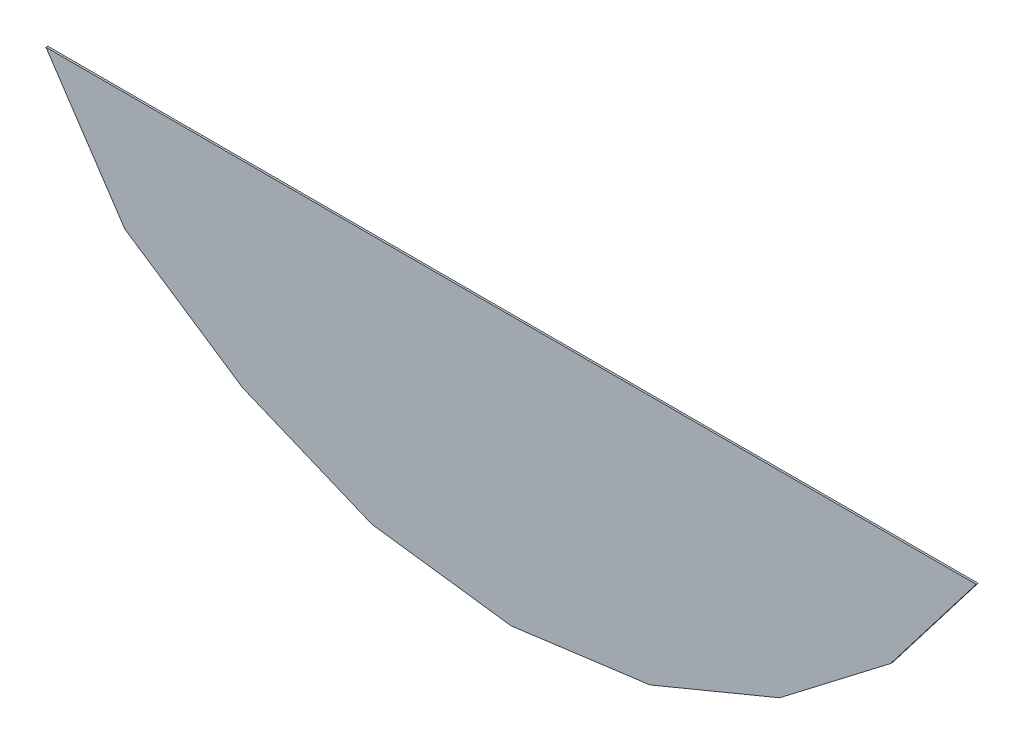
ISO-10303-21;
HEADER;
FILE_DESCRIPTION(('STEP AP214'),'2;1');
FILE_NAME('part.step','',(''),(''),'','','');
FILE_SCHEMA(('AUTOMOTIVE_DESIGN { 1 0 10303 214 1 1 1 1 }'));
ENDSEC;
DATA;
#1=APPLICATION_CONTEXT('core data for automotive mechanical design processes');
#2=APPLICATION_PROTOCOL_DEFINITION('international standard','automotive_design',2000,#1);
#3=PRODUCT_CONTEXT('',#1,'mechanical');
#4=PRODUCT('Part','Part','',(#3));
#5=PRODUCT_RELATED_PRODUCT_CATEGORY('part','',(#4));
#6=PRODUCT_DEFINITION_FORMATION('','',#4);
#7=PRODUCT_DEFINITION_CONTEXT('part definition',#1,'design');
#8=PRODUCT_DEFINITION('design','',#6,#7);
#9=PRODUCT_DEFINITION_SHAPE('','',#8);
#10=(LENGTH_UNIT() NAMED_UNIT(*) SI_UNIT(.MILLI.,.METRE.));
#11=(NAMED_UNIT(*) PLANE_ANGLE_UNIT() SI_UNIT($,.RADIAN.));
#12=(NAMED_UNIT(*) SI_UNIT($,.STERADIAN.) SOLID_ANGLE_UNIT());
#13=UNCERTAINTY_MEASURE_WITH_UNIT(LENGTH_MEASURE(1.E-05),#10,'distance_accuracy_value','');
#14=(GEOMETRIC_REPRESENTATION_CONTEXT(3) GLOBAL_UNCERTAINTY_ASSIGNED_CONTEXT((#13)) GLOBAL_UNIT_ASSIGNED_CONTEXT((#10,
#11,#12)) REPRESENTATION_CONTEXT('',''));
#15=CARTESIAN_POINT('',(0.,0.,0.));
#16=DIRECTION('',(0.,0.,1.));
#17=DIRECTION('',(1.,0.,0.));
#18=AXIS2_PLACEMENT_3D('',#15,#16,#17);
#19=CARTESIAN_POINT('',(-2.55477772,-4.28920148,3.9099998));
#20=DIRECTION('',(0.,0.,1.));
#21=DIRECTION('',(1.,0.,0.));
#22=AXIS2_PLACEMENT_3D('',#19,#20,#21);
#23=PLANE('',#22);
#24=DIRECTION('',(0.923879753352727,0.382682899206254,0.));
#25=VECTOR('',#24,1.);
#26=CARTESIAN_POINT('',(0.763513839999964,-5.66368183999992,3.9099998));
#27=LINE('',#26,#25);
#28=CARTESIAN_POINT('',(0.763513839999941,-5.66368183999987,3.9099998));
#29=VERTEX_POINT('',#28);
#30=CARTESIAN_POINT('',(1.47499832000001,-5.36897580000002,3.9099998));
#31=VERTEX_POINT('',#30);
#32=EDGE_CURVE('E90',#29,#31,#27,.T.);
#33=ORIENTED_EDGE('',*,*,#32,.T.);
#34=DIRECTION('',(0.793354187267818,0.608760325205758,0.));
#35=VECTOR('',#34,1.);
#36=CARTESIAN_POINT('',(1.47499832000001,-5.36897580000001,3.9099998));
#37=LINE('',#36,#35);
#38=CARTESIAN_POINT('',(2.08596230000003,-4.90016800000002,3.9099998));
#39=VERTEX_POINT('',#38);
#40=EDGE_CURVE('E87',#31,#39,#37,.T.);
#41=ORIENTED_EDGE('',*,*,#40,.T.);
#42=DIRECTION('',(0.608760808228389,0.793353816632351,0.));
#43=VECTOR('',#42,1.);
#44=CARTESIAN_POINT('',(2.08596230000002,-4.90016800000001,3.9099998));
#45=LINE('',#44,#43);
#46=CARTESIAN_POINT('',(2.55477264,-4.28920148,3.9099998));
#47=VERTEX_POINT('',#46);
#48=EDGE_CURVE('E19',#39,#47,#45,.T.);
#49=ORIENTED_EDGE('',*,*,#48,.T.);
#50=DIRECTION('',(1.,0.,0.));
#51=VECTOR('',#50,1.);
#52=CARTESIAN_POINT('',(-2.55477772,-4.28920148,3.9099998));
#53=LINE('',#52,#51);
#54=CARTESIAN_POINT('',(-2.5547777200001,-4.28920148000002,3.9099998));
#55=VERTEX_POINT('',#54);
#56=EDGE_CURVE('E93',#55,#47,#53,.T.);
#57=ORIENTED_EDGE('',*,*,#56,.F.);
#58=DIRECTION('',(0.555139797690147,-0.831757058894328,0.));
#59=VECTOR('',#58,1.);
#60=CARTESIAN_POINT('',(-2.55477772000007,-4.28920148000005,3.9099998));
#61=LINE('',#60,#59);
#62=CARTESIAN_POINT('',(-2.12257131999997,-4.93676939999994,3.9099998));
#63=VERTEX_POINT('',#62);
#64=EDGE_CURVE('E83',#55,#63,#61,.T.);
#65=ORIENTED_EDGE('',*,*,#64,.T.);
#66=DIRECTION('',(0.831757058894323,-0.555139797690155,0.));
#67=VECTOR('',#66,1.);
#68=CARTESIAN_POINT('',(-2.12257131999998,-4.93676939999997,3.9099998));
#69=LINE('',#68,#67);
#70=CARTESIAN_POINT('',(-1.47500340000005,-5.36897580000013,3.9099998));
#71=VERTEX_POINT('',#70);
#72=EDGE_CURVE('E104',#63,#71,#69,.T.);
#73=ORIENTED_EDGE('',*,*,#72,.T.);
#74=DIRECTION('',(0.92387975335268,-0.382682899206369,0.));
#75=VECTOR('',#74,1.);
#76=CARTESIAN_POINT('',(-1.47500340000004,-5.36897580000008,3.9099998));
#77=LINE('',#76,#75);
#78=CARTESIAN_POINT('',(-0.763518920000012,-5.66368184000013,3.9099998));
#79=VERTEX_POINT('',#78);
#80=EDGE_CURVE('E105',#71,#79,#77,.T.);
#81=ORIENTED_EDGE('',*,*,#80,.T.);
#82=DIRECTION('',(0.991445008976792,-0.130525071059199,0.));
#83=VECTOR('',#82,1.);
#84=CARTESIAN_POINT('',(-0.763518920000012,-5.66368184000008,3.9099998));
#85=LINE('',#84,#83);
#86=CARTESIAN_POINT('',(-2.54000002067E-06,-5.76419979999987,3.9099998));
#87=VERTEX_POINT('',#86);
#88=EDGE_CURVE('E109',#79,#87,#85,.T.);
#89=ORIENTED_EDGE('',*,*,#88,.T.);
#90=DIRECTION('',(0.991445008976763,0.130525071059419,0.));
#91=VECTOR('',#90,1.);
#92=CARTESIAN_POINT('',(-2.54000000806526E-06,-5.76419979999992,3.9099998));
#93=LINE('',#92,#91);
#94=EDGE_CURVE('E111',#87,#29,#93,.T.);
#95=ORIENTED_EDGE('',*,*,#94,.T.);
#96=EDGE_LOOP('',(#33,#41,#49,#57,#65,#73,#81,#89,#95));
#97=FACE_BOUND('',#96,.T.);
#98=ADVANCED_FACE('F16',(#97),#23,.T.);
#99=CARTESIAN_POINT('',(-2.55477772,-4.28920148,3.89999982));
#100=DIRECTION('',(0.,1.,0.));
#101=DIRECTION('',(0.,0.,1.));
#102=AXIS2_PLACEMENT_3D('',#99,#100,#101);
#103=PLANE('',#102);
#104=DIRECTION('',(0.,0.,1.));
#105=VECTOR('',#104,1.);
#106=CARTESIAN_POINT('',(-2.55477772000014,-4.2892014800001,3.89999982));
#107=LINE('',#106,#105);
#108=CARTESIAN_POINT('',(-2.5547777200001,-4.28920148000002,3.89999982));
#109=VERTEX_POINT('',#108);
#110=EDGE_CURVE('E115',#55,#109,#107,.F.);
#111=ORIENTED_EDGE('',*,*,#110,.F.);
#112=ORIENTED_EDGE('',*,*,#56,.T.);
#113=DIRECTION('',(0.,0.,1.));
#114=VECTOR('',#113,1.);
#115=CARTESIAN_POINT('',(2.55477264,-4.28920148,3.89999982));
#116=LINE('',#115,#114);
#117=CARTESIAN_POINT('',(2.55477264,-4.28920148,3.89999982));
#118=VERTEX_POINT('',#117);
#119=EDGE_CURVE('E98',#118,#47,#116,.T.);
#120=ORIENTED_EDGE('',*,*,#119,.F.);
#121=DIRECTION('',(1.,0.,0.));
#122=VECTOR('',#121,1.);
#123=CARTESIAN_POINT('',(-2.55477772,-4.28920148,3.89999982));
#124=LINE('',#123,#122);
#125=EDGE_CURVE('E129',#118,#109,#124,.F.);
#126=ORIENTED_EDGE('',*,*,#125,.T.);
#127=EDGE_LOOP('',(#111,#112,#120,#126));
#128=FACE_BOUND('',#127,.T.);
#129=ADVANCED_FACE('F180',(#128),#103,.T.);
#130=CARTESIAN_POINT('',(-2.12257132,-4.9367694,3.89999982));
#131=DIRECTION('',(-0.831757058894295,-0.555139797690197,0.));
#132=DIRECTION('',(0.555139797690197,-0.831757058894295,0.));
#133=AXIS2_PLACEMENT_3D('',#130,#131,#132);
#134=PLANE('',#133);
#135=DIRECTION('',(0.,0.,1.));
#136=VECTOR('',#135,1.);
#137=CARTESIAN_POINT('',(-2.12257131999991,-4.93676939999986,3.89999982));
#138=LINE('',#137,#136);
#139=CARTESIAN_POINT('',(-2.12257131999998,-4.93676939999995,3.89999982));
#140=VERTEX_POINT('',#139);
#141=EDGE_CURVE('E117',#63,#140,#138,.F.);
#142=ORIENTED_EDGE('',*,*,#141,.F.);
#143=ORIENTED_EDGE('',*,*,#64,.F.);
#144=ORIENTED_EDGE('',*,*,#110,.T.);
#145=DIRECTION('',(0.555139797690147,-0.831757058894328,0.));
#146=VECTOR('',#145,1.);
#147=CARTESIAN_POINT('',(-2.55477772000007,-4.28920148000005,3.89999982));
#148=LINE('',#147,#146);
#149=EDGE_CURVE('E132',#109,#140,#148,.T.);
#150=ORIENTED_EDGE('',*,*,#149,.T.);
#151=EDGE_LOOP('',(#142,#143,#144,#150));
#152=FACE_BOUND('',#151,.T.);
#153=ADVANCED_FACE('F177',(#152),#134,.T.);
#154=CARTESIAN_POINT('',(-1.4750034,-5.3689758,3.89999982));
#155=DIRECTION('',(-0.555139797690197,-0.831757058894295,0.));
#156=DIRECTION('',(0.831757058894295,-0.555139797690197,0.));
#157=AXIS2_PLACEMENT_3D('',#154,#155,#156);
#158=PLANE('',#157);
#159=DIRECTION('',(0.,0.,1.));
#160=VECTOR('',#159,1.);
#161=CARTESIAN_POINT('',(-1.47500340000014,-5.36897580000034,3.89999982));
#162=LINE('',#161,#160);
#163=CARTESIAN_POINT('',(-1.47500340000004,-5.36897580000011,3.89999982));
#164=VERTEX_POINT('',#163);
#165=EDGE_CURVE('E119',#71,#164,#162,.F.);
#166=ORIENTED_EDGE('',*,*,#165,.F.);
#167=ORIENTED_EDGE('',*,*,#72,.F.);
#168=ORIENTED_EDGE('',*,*,#141,.T.);
#169=DIRECTION('',(0.831757058894323,-0.555139797690155,0.));
#170=VECTOR('',#169,1.);
#171=CARTESIAN_POINT('',(-2.12257131999998,-4.93676939999997,3.89999982));
#172=LINE('',#171,#170);
#173=EDGE_CURVE('E135',#140,#164,#172,.T.);
#174=ORIENTED_EDGE('',*,*,#173,.T.);
#175=EDGE_LOOP('',(#166,#167,#168,#174));
#176=FACE_BOUND('',#175,.T.);
#177=ADVANCED_FACE('F174',(#176),#158,.T.);
#178=CARTESIAN_POINT('',(-0.76351892,-5.66368184,3.89999982));
#179=DIRECTION('',(-0.382682899205941,-0.923879753352857,0.));
#180=DIRECTION('',(0.923879753352857,-0.382682899205941,0.));
#181=AXIS2_PLACEMENT_3D('',#178,#179,#180);
#182=PLANE('',#181);
#183=DIRECTION('',(0.,0.,1.));
#184=VECTOR('',#183,1.);
#185=CARTESIAN_POINT('',(-0.763518920000046,-5.66368184000034,3.89999982));
#186=LINE('',#185,#184);
#187=CARTESIAN_POINT('',(-0.763518920000005,-5.66368184000011,3.89999982));
#188=VERTEX_POINT('',#187);
#189=EDGE_CURVE('E121',#79,#188,#186,.F.);
#190=ORIENTED_EDGE('',*,*,#189,.F.);
#191=ORIENTED_EDGE('',*,*,#80,.F.);
#192=ORIENTED_EDGE('',*,*,#165,.T.);
#193=DIRECTION('',(0.92387975335268,-0.382682899206368,0.));
#194=VECTOR('',#193,1.);
#195=CARTESIAN_POINT('',(-1.47500340000004,-5.36897580000008,3.89999982));
#196=LINE('',#195,#194);
#197=EDGE_CURVE('E138',#164,#188,#196,.T.);
#198=ORIENTED_EDGE('',*,*,#197,.T.);
#199=EDGE_LOOP('',(#190,#191,#192,#198));
#200=FACE_BOUND('',#199,.T.);
#201=ADVANCED_FACE('F169',(#200),#182,.T.);
#202=CARTESIAN_POINT('',(-2.539999996998E-06,-5.7641998,3.89999982));
#203=DIRECTION('',(-0.130525071058976,-0.991445008976821,0.));
#204=DIRECTION('',(0.991445008976821,-0.130525071058976,0.));
#205=AXIS2_PLACEMENT_3D('',#202,#203,#204);
#206=PLANE('',#205);
#207=DIRECTION('',(0.,0.,1.));
#208=VECTOR('',#207,1.);
#209=CARTESIAN_POINT('',(-2.54000004167552E-06,-5.76419979999966,3.89999982));
#210=LINE('',#209,#208);
#211=CARTESIAN_POINT('',(-2.54000002262806E-06,-5.76419979999989,3.89999982));
#212=VERTEX_POINT('',#211);
#213=EDGE_CURVE('E123',#87,#212,#210,.F.);
#214=ORIENTED_EDGE('',*,*,#213,.F.);
#215=ORIENTED_EDGE('',*,*,#88,.F.);
#216=ORIENTED_EDGE('',*,*,#189,.T.);
#217=DIRECTION('',(0.991445008976792,-0.130525071059199,0.));
#218=VECTOR('',#217,1.);
#219=CARTESIAN_POINT('',(-0.763518920000012,-5.66368184000008,3.89999982));
#220=LINE('',#219,#218);
#221=EDGE_CURVE('E141',#188,#212,#220,.T.);
#222=ORIENTED_EDGE('',*,*,#221,.T.);
#223=EDGE_LOOP('',(#214,#215,#216,#222));
#224=FACE_BOUND('',#223,.T.);
#225=ADVANCED_FACE('F164',(#224),#206,.T.);
#226=CARTESIAN_POINT('',(0.76351384,-5.66368184,3.89999982));
#227=DIRECTION('',(0.130525071058976,-0.991445008976821,0.));
#228=DIRECTION('',(0.991445008976821,0.130525071058976,0.));
#229=AXIS2_PLACEMENT_3D('',#226,#227,#228);
#230=PLANE('',#229);
#231=DIRECTION('',(0.,0.,1.));
#232=VECTOR('',#231,1.);
#233=CARTESIAN_POINT('',(0.763513839999859,-5.66368183999966,3.89999982));
#234=LINE('',#233,#232);
#235=CARTESIAN_POINT('',(0.763513839999943,-5.6636818399999,3.89999982));
#236=VERTEX_POINT('',#235);
#237=EDGE_CURVE('E125',#29,#236,#234,.F.);
#238=ORIENTED_EDGE('',*,*,#237,.F.);
#239=ORIENTED_EDGE('',*,*,#94,.F.);
#240=ORIENTED_EDGE('',*,*,#213,.T.);
#241=DIRECTION('',(0.991445008976763,0.130525071059419,0.));
#242=VECTOR('',#241,1.);
#243=CARTESIAN_POINT('',(-2.54000000806526E-06,-5.76419979999992,3.89999982));
#244=LINE('',#243,#242);
#245=EDGE_CURVE('E144',#212,#236,#244,.T.);
#246=ORIENTED_EDGE('',*,*,#245,.T.);
#247=EDGE_LOOP('',(#238,#239,#240,#246));
#248=FACE_BOUND('',#247,.T.);
#249=ADVANCED_FACE('F159',(#248),#230,.T.);
#250=CARTESIAN_POINT('',(1.47499832,-5.3689758,3.89999982));
#251=DIRECTION('',(0.382682899205941,-0.923879753352857,0.));
#252=DIRECTION('',(0.923879753352857,0.382682899205941,0.));
#253=AXIS2_PLACEMENT_3D('',#250,#251,#252);
#254=PLANE('',#253);
#255=DIRECTION('',(0.,0.,1.));
#256=VECTOR('',#255,1.);
#257=CARTESIAN_POINT('',(1.47499832000003,-5.36897580000004,3.89999982));
#258=LINE('',#257,#256);
#259=CARTESIAN_POINT('',(1.47499832000001,-5.36897580000001,3.89999982));
#260=VERTEX_POINT('',#259);
#261=EDGE_CURVE('E99',#31,#260,#258,.F.);
#262=ORIENTED_EDGE('',*,*,#261,.F.);
#263=ORIENTED_EDGE('',*,*,#32,.F.);
#264=ORIENTED_EDGE('',*,*,#237,.T.);
#265=DIRECTION('',(0.923879753352727,0.382682899206254,0.));
#266=VECTOR('',#265,1.);
#267=CARTESIAN_POINT('',(0.763513839999964,-5.66368183999992,3.89999982));
#268=LINE('',#267,#266);
#269=EDGE_CURVE('E147',#236,#260,#268,.T.);
#270=ORIENTED_EDGE('',*,*,#269,.T.);
#271=EDGE_LOOP('',(#262,#263,#264,#270));
#272=FACE_BOUND('',#271,.T.);
#273=ADVANCED_FACE('F152',(#272),#254,.T.);
#274=CARTESIAN_POINT('',(2.0859623,-4.900168,3.89999982));
#275=DIRECTION('',(0.608760325205822,-0.793354187267769,0.));
#276=DIRECTION('',(0.793354187267769,0.608760325205822,0.));
#277=AXIS2_PLACEMENT_3D('',#274,#275,#276);
#278=PLANE('',#277);
#279=DIRECTION('',(0.,0.,1.));
#280=VECTOR('',#279,1.);
#281=CARTESIAN_POINT('',(2.08596230000008,-4.90016800000006,3.89999982));
#282=LINE('',#281,#280);
#283=CARTESIAN_POINT('',(2.08596230000003,-4.90016800000002,3.89999982));
#284=VERTEX_POINT('',#283);
#285=EDGE_CURVE('E33',#39,#284,#282,.F.);
#286=ORIENTED_EDGE('',*,*,#285,.F.);
#287=ORIENTED_EDGE('',*,*,#40,.F.);
#288=ORIENTED_EDGE('',*,*,#261,.T.);
#289=DIRECTION('',(0.793354187267818,0.608760325205758,0.));
#290=VECTOR('',#289,1.);
#291=CARTESIAN_POINT('',(1.47499832000001,-5.36897580000001,3.89999982));
#292=LINE('',#291,#290);
#293=EDGE_CURVE('E25',#260,#284,#292,.T.);
#294=ORIENTED_EDGE('',*,*,#293,.T.);
#295=EDGE_LOOP('',(#286,#287,#288,#294));
#296=FACE_BOUND('',#295,.T.);
#297=ADVANCED_FACE('F96',(#296),#278,.T.);
#298=CARTESIAN_POINT('',(2.55477264,-4.28920148,3.89999982));
#299=DIRECTION('',(0.793353816632409,-0.608760808228314,0.));
#300=DIRECTION('',(0.608760808228314,0.793353816632409,0.));
#301=AXIS2_PLACEMENT_3D('',#298,#299,#300);
#302=PLANE('',#301);
#303=ORIENTED_EDGE('',*,*,#119,.T.);
#304=ORIENTED_EDGE('',*,*,#48,.F.);
#305=ORIENTED_EDGE('',*,*,#285,.T.);
#306=DIRECTION('',(0.608760808228389,0.793353816632351,0.));
#307=VECTOR('',#306,1.);
#308=CARTESIAN_POINT('',(2.08596230000002,-4.90016800000001,3.89999982));
#309=LINE('',#308,#307);
#310=EDGE_CURVE('E11',#284,#118,#309,.T.);
#311=ORIENTED_EDGE('',*,*,#310,.T.);
#312=EDGE_LOOP('',(#303,#304,#305,#311));
#313=FACE_BOUND('',#312,.T.);
#314=ADVANCED_FACE('F102',(#313),#302,.T.);
#315=CARTESIAN_POINT('',(-2.55477772,-4.28920148,3.89999982));
#316=DIRECTION('',(0.,0.,1.));
#317=DIRECTION('',(1.,0.,0.));
#318=AXIS2_PLACEMENT_3D('',#315,#316,#317);
#319=PLANE('',#318);
#320=ORIENTED_EDGE('',*,*,#293,.F.);
#321=ORIENTED_EDGE('',*,*,#269,.F.);
#322=ORIENTED_EDGE('',*,*,#245,.F.);
#323=ORIENTED_EDGE('',*,*,#221,.F.);
#324=ORIENTED_EDGE('',*,*,#197,.F.);
#325=ORIENTED_EDGE('',*,*,#173,.F.);
#326=ORIENTED_EDGE('',*,*,#149,.F.);
#327=ORIENTED_EDGE('',*,*,#125,.F.);
#328=ORIENTED_EDGE('',*,*,#310,.F.);
#329=EDGE_LOOP('',(#320,#321,#322,#323,#324,#325,#326,#327,#328));
#330=FACE_BOUND('',#329,.T.);
#331=ADVANCED_FACE('F156',(#330),#319,.F.);
#332=CLOSED_SHELL('',(#98,#129,#153,#177,#201,#225,#249,#273,#297,#314,#331));
#333=MANIFOLD_SOLID_BREP('B1',#332);
#334=ADVANCED_BREP_SHAPE_REPRESENTATION('',(#18,#333),#14);
#335=SHAPE_DEFINITION_REPRESENTATION(#9,#334);
ENDSEC;
END-ISO-10303-21;
